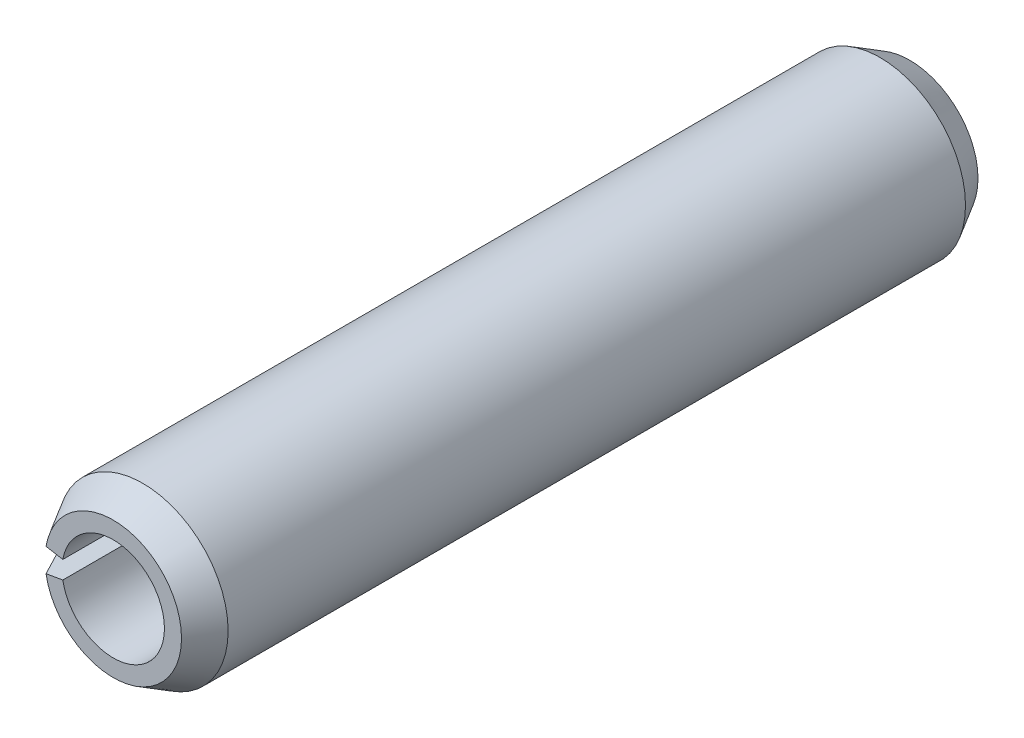
ISO-10303-21;
HEADER;
FILE_DESCRIPTION(('STEP AP214'),'2;1');
FILE_NAME('part.step','',(''),(''),'','','');
FILE_SCHEMA(('AUTOMOTIVE_DESIGN { 1 0 10303 214 1 1 1 1 }'));
ENDSEC;
DATA;
#1=APPLICATION_CONTEXT('core data for automotive mechanical design processes');
#2=APPLICATION_PROTOCOL_DEFINITION('international standard','automotive_design',2000,#1);
#3=PRODUCT_CONTEXT('',#1,'mechanical');
#4=PRODUCT('Part','Part','',(#3));
#5=PRODUCT_RELATED_PRODUCT_CATEGORY('part','',(#4));
#6=PRODUCT_DEFINITION_FORMATION('','',#4);
#7=PRODUCT_DEFINITION_CONTEXT('part definition',#1,'design');
#8=PRODUCT_DEFINITION('design','',#6,#7);
#9=PRODUCT_DEFINITION_SHAPE('','',#8);
#10=(LENGTH_UNIT() NAMED_UNIT(*) SI_UNIT(.MILLI.,.METRE.));
#11=(NAMED_UNIT(*) PLANE_ANGLE_UNIT() SI_UNIT($,.RADIAN.));
#12=(NAMED_UNIT(*) SI_UNIT($,.STERADIAN.) SOLID_ANGLE_UNIT());
#13=UNCERTAINTY_MEASURE_WITH_UNIT(LENGTH_MEASURE(1.E-05),#10,'distance_accuracy_value','');
#14=(GEOMETRIC_REPRESENTATION_CONTEXT(3) GLOBAL_UNCERTAINTY_ASSIGNED_CONTEXT((#13)) GLOBAL_UNIT_ASSIGNED_CONTEXT((#10,
#11,#12)) REPRESENTATION_CONTEXT('',''));
#15=CARTESIAN_POINT('',(0.,0.,0.));
#16=DIRECTION('',(0.,0.,1.));
#17=DIRECTION('',(1.,0.,0.));
#18=AXIS2_PLACEMENT_3D('',#15,#16,#17);
#19=CARTESIAN_POINT('',(0.,1.2,7.));
#20=DIRECTION('',(0.,0.,1.));
#21=DIRECTION('',(1.,0.,0.));
#22=AXIS2_PLACEMENT_3D('',#19,#20,#21);
#23=PLANE('',#22);
#24=CARTESIAN_POINT('',(0.,0.,7.));
#25=DIRECTION('',(0.,0.,-1.));
#26=DIRECTION('',(-0.984807753012208,0.173648177666932,0.));
#27=AXIS2_PLACEMENT_3D('',#24,#25,#26);
#28=CIRCLE('',#27,0.9);
#29=CARTESIAN_POINT('',(-0.886326977710987,0.156283359900239,7.));
#30=VERTEX_POINT('',#29);
#31=CARTESIAN_POINT('',(-0.886326977710987,-0.156283359900239,7.));
#32=VERTEX_POINT('',#31);
#33=EDGE_CURVE('E83',#30,#32,#28,.T.);
#34=ORIENTED_EDGE('',*,*,#33,.T.);
#35=DIRECTION('',(-0.984807753012208,-0.173648177666931,0.));
#36=VECTOR('',#35,1.);
#37=CARTESIAN_POINT('',(-0.886326977710987,-0.156283359900239,7.));
#38=LINE('',#37,#36);
#39=CARTESIAN_POINT('',(-1.18176930361465,-0.208377813200318,7.));
#40=VERTEX_POINT('',#39);
#41=EDGE_CURVE('E70',#32,#40,#38,.T.);
#42=ORIENTED_EDGE('',*,*,#41,.T.);
#43=CARTESIAN_POINT('',(0.,0.,7.));
#44=DIRECTION('',(0.,0.,-1.));
#45=DIRECTION('',(-0.984807753012208,0.173648177666931,0.));
#46=AXIS2_PLACEMENT_3D('',#43,#44,#45);
#47=CIRCLE('',#46,1.2);
#48=CARTESIAN_POINT('',(-1.18176930361465,0.208377813200318,7.));
#49=VERTEX_POINT('',#48);
#50=EDGE_CURVE('E82',#49,#40,#47,.T.);
#51=ORIENTED_EDGE('',*,*,#50,.F.);
#52=DIRECTION('',(0.984807753012208,-0.173648177666932,0.));
#53=VECTOR('',#52,1.);
#54=CARTESIAN_POINT('',(-1.18176930361465,0.208377813200318,7.));
#55=LINE('',#54,#53);
#56=EDGE_CURVE('E95',#49,#30,#55,.T.);
#57=ORIENTED_EDGE('',*,*,#56,.T.);
#58=EDGE_LOOP('',(#34,#42,#51,#57));
#59=FACE_BOUND('',#58,.T.);
#60=ADVANCED_FACE('F16',(#59),#23,.T.);
#61=CARTESIAN_POINT('',(0.,0.,-7.));
#62=DIRECTION('',(0.,0.,-1.));
#63=DIRECTION('',(-1.,0.,0.));
#64=AXIS2_PLACEMENT_3D('',#61,#62,#63);
#65=CYLINDRICAL_SURFACE('',#64,0.9);
#66=CARTESIAN_POINT('',(0.,0.,-7.));
#67=DIRECTION('',(0.,0.,-1.));
#68=DIRECTION('',(-0.984807753012208,0.173648177666932,0.));
#69=AXIS2_PLACEMENT_3D('',#66,#67,#68);
#70=CIRCLE('',#69,0.9);
#71=CARTESIAN_POINT('',(-0.886326977710987,0.156283359900239,-7.));
#72=VERTEX_POINT('',#71);
#73=CARTESIAN_POINT('',(-0.886326977710987,-0.156283359900239,-7.));
#74=VERTEX_POINT('',#73);
#75=EDGE_CURVE('E90',#72,#74,#70,.T.);
#76=ORIENTED_EDGE('',*,*,#75,.T.);
#77=DIRECTION('',(0.,0.,1.));
#78=VECTOR('',#77,1.);
#79=CARTESIAN_POINT('',(-0.886326977710987,-0.156283359900239,-7.));
#80=LINE('',#79,#78);
#81=EDGE_CURVE('E74',#74,#32,#80,.T.);
#82=ORIENTED_EDGE('',*,*,#81,.T.);
#83=ORIENTED_EDGE('',*,*,#33,.F.);
#84=DIRECTION('',(0.,0.,-1.));
#85=VECTOR('',#84,1.);
#86=CARTESIAN_POINT('',(-0.886326977710987,0.156283359900239,7.));
#87=LINE('',#86,#85);
#88=EDGE_CURVE('E92',#30,#72,#87,.T.);
#89=ORIENTED_EDGE('',*,*,#88,.T.);
#90=EDGE_LOOP('',(#76,#82,#83,#89));
#91=FACE_BOUND('',#90,.T.);
#92=ADVANCED_FACE('F88',(#91),#65,.F.);
#93=CARTESIAN_POINT('',(-2.9544232590366,-0.52094453300079,14.));
#94=DIRECTION('',(-0.173648177666931,0.984807753012208,0.));
#95=DIRECTION('',(-0.984807753012208,-0.173648177666931,0.));
#96=AXIS2_PLACEMENT_3D('',#93,#94,#95);
#97=PLANE('',#96);
#98=ORIENTED_EDGE('',*,*,#81,.F.);
#99=DIRECTION('',(0.984807753012208,0.173648177666931,0.));
#100=VECTOR('',#99,1.);
#101=CARTESIAN_POINT('',(-1.18176930361465,-0.208377813200318,-7.));
#102=LINE('',#101,#100);
#103=CARTESIAN_POINT('',(-1.18176930361465,-0.208377813200318,-7.));
#104=VERTEX_POINT('',#103);
#105=EDGE_CURVE('E120',#104,#74,#102,.T.);
#106=ORIENTED_EDGE('',*,*,#105,.F.);
#107=DIRECTION('',(0.492403876506078,0.0868240888334611,-0.866025403784454));
#108=VECTOR('',#107,1.);
#109=CARTESIAN_POINT('',(-1.47721162951831,-0.260472266500397,-6.4803847577293));
#110=LINE('',#109,#108);
#111=CARTESIAN_POINT('',(-1.47721162951831,-0.260472266500397,-6.4803847577293));
#112=VERTEX_POINT('',#111);
#113=EDGE_CURVE('E125',#112,#104,#110,.T.);
#114=ORIENTED_EDGE('',*,*,#113,.F.);
#115=DIRECTION('',(0.,0.,-1.));
#116=VECTOR('',#115,1.);
#117=CARTESIAN_POINT('',(-1.47721162951831,-0.260472266500397,6.4803847577293));
#118=LINE('',#117,#116);
#119=CARTESIAN_POINT('',(-1.47721162951831,-0.260472266500397,6.4803847577293));
#120=VERTEX_POINT('',#119);
#121=EDGE_CURVE('E130',#120,#112,#118,.T.);
#122=ORIENTED_EDGE('',*,*,#121,.F.);
#123=DIRECTION('',(-0.492403876506078,-0.0868240888334611,-0.866025403784454));
#124=VECTOR('',#123,1.);
#125=CARTESIAN_POINT('',(-1.18176930361465,-0.208377813200318,7.));
#126=LINE('',#125,#124);
#127=EDGE_CURVE('E77',#40,#120,#126,.T.);
#128=ORIENTED_EDGE('',*,*,#127,.F.);
#129=ORIENTED_EDGE('',*,*,#41,.F.);
#130=EDGE_LOOP('',(#98,#106,#114,#122,#128,#129));
#131=FACE_BOUND('',#130,.T.);
#132=ADVANCED_FACE('F72',(#131),#97,.T.);
#133=CARTESIAN_POINT('',(0.,0.,6.4803847577293));
#134=DIRECTION('',(0.,0.,-1.));
#135=DIRECTION('',(-1.,0.,0.));
#136=AXIS2_PLACEMENT_3D('',#133,#134,#135);
#137=CONICAL_SURFACE('',#136,1.5,0.523598775598268);
#138=ORIENTED_EDGE('',*,*,#50,.T.);
#139=ORIENTED_EDGE('',*,*,#127,.T.);
#140=CARTESIAN_POINT('',(0.,0.,6.4803847577293));
#141=DIRECTION('',(0.,0.,-1.));
#142=DIRECTION('',(-0.984807753012208,0.173648177666932,0.));
#143=AXIS2_PLACEMENT_3D('',#140,#141,#142);
#144=CIRCLE('',#143,1.5);
#145=CARTESIAN_POINT('',(-1.47721162951831,0.260472266500398,6.4803847577293));
#146=VERTEX_POINT('',#145);
#147=EDGE_CURVE('E139',#146,#120,#144,.T.);
#148=ORIENTED_EDGE('',*,*,#147,.F.);
#149=DIRECTION('',(0.492403876506078,-0.0868240888334611,0.866025403784454));
#150=VECTOR('',#149,1.);
#151=CARTESIAN_POINT('',(-1.47721162951831,0.260472266500397,6.4803847577293));
#152=LINE('',#151,#150);
#153=EDGE_CURVE('E144',#146,#49,#152,.T.);
#154=ORIENTED_EDGE('',*,*,#153,.T.);
#155=EDGE_LOOP('',(#138,#139,#148,#154));
#156=FACE_BOUND('',#155,.T.);
#157=ADVANCED_FACE('F181',(#156),#137,.T.);
#158=CARTESIAN_POINT('',(0.,0.,14.));
#159=DIRECTION('',(-0.173648177666931,-0.984807753012208,0.));
#160=DIRECTION('',(0.984807753012208,-0.173648177666931,0.));
#161=AXIS2_PLACEMENT_3D('',#158,#159,#160);
#162=PLANE('',#161);
#163=ORIENTED_EDGE('',*,*,#153,.F.);
#164=DIRECTION('',(0.,0.,1.));
#165=VECTOR('',#164,1.);
#166=CARTESIAN_POINT('',(-1.47721162951831,0.260472266500397,-6.4803847577293));
#167=LINE('',#166,#165);
#168=CARTESIAN_POINT('',(-1.47721162951831,0.260472266500397,-6.4803847577293));
#169=VERTEX_POINT('',#168);
#170=EDGE_CURVE('E150',#169,#146,#167,.T.);
#171=ORIENTED_EDGE('',*,*,#170,.F.);
#172=DIRECTION('',(-0.492403876506078,0.0868240888334611,0.866025403784454));
#173=VECTOR('',#172,1.);
#174=CARTESIAN_POINT('',(-1.18176930361465,0.208377813200318,-7.));
#175=LINE('',#174,#173);
#176=CARTESIAN_POINT('',(-1.18176930361465,0.208377813200318,-7.));
#177=VERTEX_POINT('',#176);
#178=EDGE_CURVE('E155',#177,#169,#175,.T.);
#179=ORIENTED_EDGE('',*,*,#178,.F.);
#180=DIRECTION('',(-0.984807753012208,0.173648177666932,0.));
#181=VECTOR('',#180,1.);
#182=CARTESIAN_POINT('',(-0.886326977710987,0.156283359900238,-7.));
#183=LINE('',#182,#181);
#184=EDGE_CURVE('E160',#72,#177,#183,.T.);
#185=ORIENTED_EDGE('',*,*,#184,.F.);
#186=ORIENTED_EDGE('',*,*,#88,.F.);
#187=ORIENTED_EDGE('',*,*,#56,.F.);
#188=EDGE_LOOP('',(#163,#171,#179,#185,#186,#187));
#189=FACE_BOUND('',#188,.T.);
#190=ADVANCED_FACE('F178',(#189),#162,.T.);
#191=CARTESIAN_POINT('',(0.,0.9,-7.));
#192=DIRECTION('',(0.,0.,-1.));
#193=DIRECTION('',(-1.,0.,0.));
#194=AXIS2_PLACEMENT_3D('',#191,#192,#193);
#195=PLANE('',#194);
#196=CARTESIAN_POINT('',(0.,0.,-7.));
#197=DIRECTION('',(0.,0.,-1.));
#198=DIRECTION('',(-0.984807753012208,0.173648177666931,0.));
#199=AXIS2_PLACEMENT_3D('',#196,#197,#198);
#200=CIRCLE('',#199,1.2);
#201=EDGE_CURVE('E26',#177,#104,#200,.T.);
#202=ORIENTED_EDGE('',*,*,#201,.T.);
#203=ORIENTED_EDGE('',*,*,#105,.T.);
#204=ORIENTED_EDGE('',*,*,#75,.F.);
#205=ORIENTED_EDGE('',*,*,#184,.T.);
#206=EDGE_LOOP('',(#202,#203,#204,#205));
#207=FACE_BOUND('',#206,.T.);
#208=ADVANCED_FACE('F172',(#207),#195,.T.);
#209=CARTESIAN_POINT('',(0.,0.,-7.));
#210=DIRECTION('',(0.,0.,1.));
#211=DIRECTION('',(1.,0.,0.));
#212=AXIS2_PLACEMENT_3D('',#209,#210,#211);
#213=CONICAL_SURFACE('',#212,1.2,0.523598775598268);
#214=CARTESIAN_POINT('',(0.,0.,-6.4803847577293));
#215=DIRECTION('',(0.,0.,-1.));
#216=DIRECTION('',(-0.984807753012208,0.173648177666931,0.));
#217=AXIS2_PLACEMENT_3D('',#214,#215,#216);
#218=CIRCLE('',#217,1.5);
#219=EDGE_CURVE('E10',#169,#112,#218,.T.);
#220=ORIENTED_EDGE('',*,*,#219,.T.);
#221=ORIENTED_EDGE('',*,*,#113,.T.);
#222=ORIENTED_EDGE('',*,*,#201,.F.);
#223=ORIENTED_EDGE('',*,*,#178,.T.);
#224=EDGE_LOOP('',(#220,#221,#222,#223));
#225=FACE_BOUND('',#224,.T.);
#226=ADVANCED_FACE('F175',(#225),#213,.T.);
#227=CARTESIAN_POINT('',(0.,0.,-7.));
#228=DIRECTION('',(0.,0.,-1.));
#229=DIRECTION('',(-1.,0.,0.));
#230=AXIS2_PLACEMENT_3D('',#227,#228,#229);
#231=CYLINDRICAL_SURFACE('',#230,1.5);
#232=ORIENTED_EDGE('',*,*,#147,.T.);
#233=ORIENTED_EDGE('',*,*,#121,.T.);
#234=ORIENTED_EDGE('',*,*,#219,.F.);
#235=ORIENTED_EDGE('',*,*,#170,.T.);
#236=EDGE_LOOP('',(#232,#233,#234,#235));
#237=FACE_BOUND('',#236,.T.);
#238=ADVANCED_FACE('F18',(#237),#231,.T.);
#239=CLOSED_SHELL('',(#60,#92,#132,#157,#190,#208,#226,#238));
#240=MANIFOLD_SOLID_BREP('B1',#239);
#241=ADVANCED_BREP_SHAPE_REPRESENTATION('',(#18,#240),#14);
#242=SHAPE_DEFINITION_REPRESENTATION(#9,#241);
ENDSEC;
END-ISO-10303-21;
